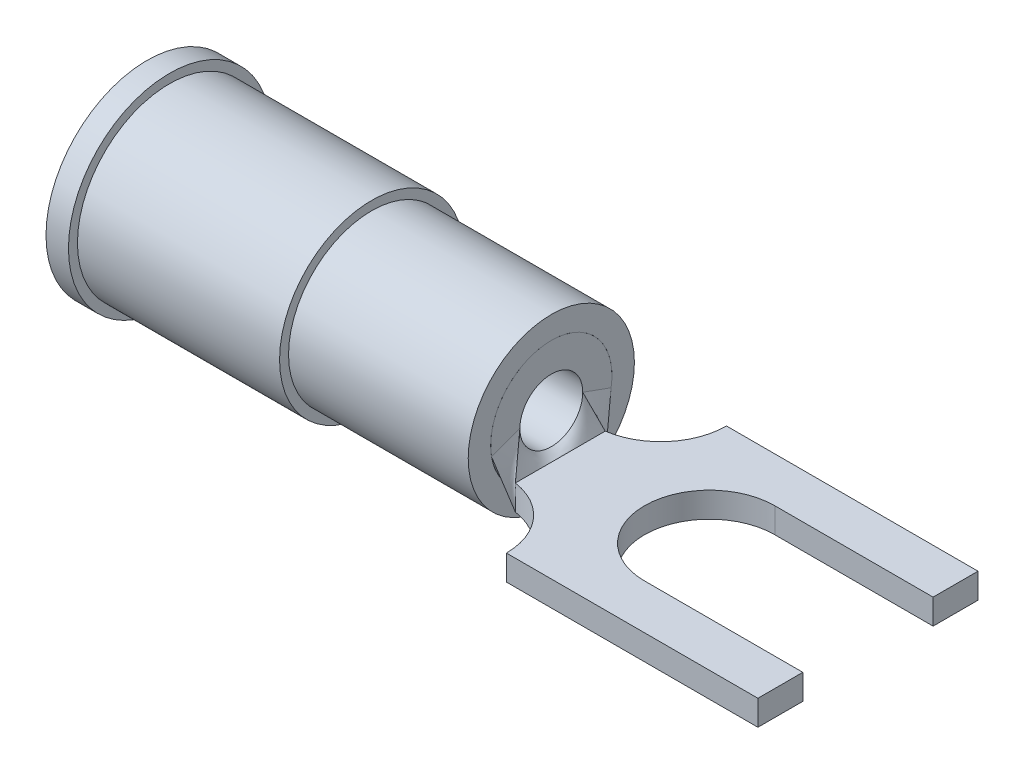
ISO-10303-21;
HEADER;
FILE_DESCRIPTION(('STEP AP214'),'2;1');
FILE_NAME('part.step','',(''),(''),'','','');
FILE_SCHEMA(('AUTOMOTIVE_DESIGN { 1 0 10303 214 1 1 1 1 }'));
ENDSEC;
DATA;
#1=APPLICATION_CONTEXT('core data for automotive mechanical design processes');
#2=APPLICATION_PROTOCOL_DEFINITION('international standard','automotive_design',2000,#1);
#3=PRODUCT_CONTEXT('',#1,'mechanical');
#4=PRODUCT('Part','Part','',(#3));
#5=PRODUCT_RELATED_PRODUCT_CATEGORY('part','',(#4));
#6=PRODUCT_DEFINITION_FORMATION('','',#4);
#7=PRODUCT_DEFINITION_CONTEXT('part definition',#1,'design');
#8=PRODUCT_DEFINITION('design','',#6,#7);
#9=PRODUCT_DEFINITION_SHAPE('','',#8);
#10=(LENGTH_UNIT() NAMED_UNIT(*) SI_UNIT(.MILLI.,.METRE.));
#11=(NAMED_UNIT(*) PLANE_ANGLE_UNIT() SI_UNIT($,.RADIAN.));
#12=(NAMED_UNIT(*) SI_UNIT($,.STERADIAN.) SOLID_ANGLE_UNIT());
#13=UNCERTAINTY_MEASURE_WITH_UNIT(LENGTH_MEASURE(1.E-05),#10,'distance_accuracy_value','');
#14=(GEOMETRIC_REPRESENTATION_CONTEXT(3) GLOBAL_UNCERTAINTY_ASSIGNED_CONTEXT((#13)) GLOBAL_UNIT_ASSIGNED_CONTEXT((#10,
#11,#12)) REPRESENTATION_CONTEXT('',''));
#15=CARTESIAN_POINT('',(0.,0.,0.));
#16=DIRECTION('',(0.,0.,1.));
#17=DIRECTION('',(1.,0.,0.));
#18=AXIS2_PLACEMENT_3D('',#15,#16,#17);
#19=CARTESIAN_POINT('',(11.684,-1.7272,-1.27));
#20=DIRECTION('',(-1.,0.,0.));
#21=DIRECTION('',(0.,0.,1.));
#22=AXIS2_PLACEMENT_3D('',#19,#20,#21);
#23=PLANE('',#22);
#24=DIRECTION('',(0.,0.,1.));
#25=VECTOR('',#24,1.);
#26=CARTESIAN_POINT('',(11.684,-1.016,-1.27));
#27=LINE('',#26,#25);
#28=CARTESIAN_POINT('',(11.684,-1.016,-1.27));
#29=VERTEX_POINT('',#28);
#30=CARTESIAN_POINT('',(11.684,-1.016,1.27));
#31=VERTEX_POINT('',#30);
#32=EDGE_CURVE('E193',#29,#31,#27,.T.);
#33=ORIENTED_EDGE('',*,*,#32,.T.);
#34=DIRECTION('',(0.,1.,0.));
#35=VECTOR('',#34,1.);
#36=CARTESIAN_POINT('',(11.684,-1.7272,1.27));
#37=LINE('',#36,#35);
#38=CARTESIAN_POINT('',(11.684,-1.7272,1.27));
#39=VERTEX_POINT('',#38);
#40=EDGE_CURVE('E102',#39,#31,#37,.T.);
#41=ORIENTED_EDGE('',*,*,#40,.F.);
#42=DIRECTION('',(0.,0.,1.));
#43=VECTOR('',#42,1.);
#44=CARTESIAN_POINT('',(11.684,-1.7272,-1.27));
#45=LINE('',#44,#43);
#46=CARTESIAN_POINT('',(11.684,-1.7272,-1.27));
#47=VERTEX_POINT('',#46);
#48=EDGE_CURVE('E295',#47,#39,#45,.T.);
#49=ORIENTED_EDGE('',*,*,#48,.F.);
#50=DIRECTION('',(0.,1.,0.));
#51=VECTOR('',#50,1.);
#52=CARTESIAN_POINT('',(11.684,-1.7272,-1.27));
#53=LINE('',#52,#51);
#54=EDGE_CURVE('E141',#47,#29,#53,.T.);
#55=ORIENTED_EDGE('',*,*,#54,.T.);
#56=EDGE_LOOP('',(#33,#41,#49,#55));
#57=FACE_BOUND('',#56,.T.);
#58=ADVANCED_FACE('F67',(#57),#23,.F.);
#59=CARTESIAN_POINT('',(11.43,0.,0.));
#60=DIRECTION('',(1.,0.,0.));
#61=DIRECTION('',(0.,0.,-1.));
#62=AXIS2_PLACEMENT_3D('',#59,#60,#61);
#63=PLANE('',#62);
#64=DIRECTION('',(0.,0.34202014332567,-0.939692620785908));
#65=VECTOR('',#64,1.);
#66=CARTESIAN_POINT('',(11.43,0.285719092505667,0.103993245033615));
#67=LINE('',#66,#65);
#68=CARTESIAN_POINT('',(11.43,-0.291379498495464,1.6895585926083));
#69=VERTEX_POINT('',#68);
#70=CARTESIAN_POINT('',(11.43,0.,0.889));
#71=VERTEX_POINT('',#70);
#72=EDGE_CURVE('E135',#69,#71,#67,.T.);
#73=ORIENTED_EDGE('',*,*,#72,.T.);
#74=CARTESIAN_POINT('',(11.43,0.,0.));
#75=DIRECTION('',(1.,0.,0.));
#76=DIRECTION('',(0.,0.,-1.));
#77=AXIS2_PLACEMENT_3D('',#74,#75,#76);
#78=CIRCLE('',#77,0.889);
#79=CARTESIAN_POINT('',(11.43,0.,-0.889));
#80=VERTEX_POINT('',#79);
#81=EDGE_CURVE('E13',#71,#80,#78,.T.);
#82=ORIENTED_EDGE('',*,*,#81,.T.);
#83=DIRECTION('',(0.,-0.34202014332567,-0.939692620785908));
#84=VECTOR('',#83,1.);
#85=CARTESIAN_POINT('',(11.43,0.285719092505667,-0.103993245033615));
#86=LINE('',#85,#84);
#87=CARTESIAN_POINT('',(11.43,-0.291379498495464,-1.6895585926083));
#88=VERTEX_POINT('',#87);
#89=EDGE_CURVE('E78',#80,#88,#86,.T.);
#90=ORIENTED_EDGE('',*,*,#89,.T.);
#91=CARTESIAN_POINT('',(11.43,0.,0.));
#92=DIRECTION('',(1.,0.,0.));
#93=DIRECTION('',(0.,0.,-1.));
#94=AXIS2_PLACEMENT_3D('',#91,#92,#93);
#95=CIRCLE('',#94,1.7145);
#96=EDGE_CURVE('E114',#69,#88,#95,.T.);
#97=ORIENTED_EDGE('',*,*,#96,.F.);
#98=EDGE_LOOP('',(#73,#82,#90,#97));
#99=FACE_BOUND('',#98,.T.);
#100=ADVANCED_FACE('F118',(#99),#63,.F.);
#101=CARTESIAN_POINT('',(11.43,-0.291379498495464,1.6895585926083));
#102=CARTESIAN_POINT('',(11.684,-1.7272,1.27));
#103=CARTESIAN_POINT('',(11.43,-0.430127833182765,1.6656302006868));
#104=CARTESIAN_POINT('',(11.684,-1.7272,1.16416666666667));
#105=CARTESIAN_POINT('',(11.43,-0.581040716903704,1.62218906384854));
#106=CARTESIAN_POINT('',(11.684,-1.7272,1.05833333333333));
#107=CARTESIAN_POINT('',(11.43,-0.891753825247846,1.4744086233896));
#108=CARTESIAN_POINT('',(11.684,-1.7272,0.846666666666665));
#109=CARTESIAN_POINT('',(11.43,-1.05167604388082,1.36940823154506));
#110=CARTESIAN_POINT('',(11.684,-1.7272,0.740833333333331));
#111=CARTESIAN_POINT('',(11.43,-1.3441775724631,1.08373800320161));
#112=CARTESIAN_POINT('',(11.684,-1.7272,0.529166666666664));
#113=CARTESIAN_POINT('',(11.43,-1.47596562928428,0.902303444981081));
#114=CARTESIAN_POINT('',(11.684,-1.7272,0.42333333333333));
#115=CARTESIAN_POINT('',(11.43,-1.66184767881455,0.48050841623427));
#116=CARTESIAN_POINT('',(11.684,-1.7272,0.211666666666663));
#117=CARTESIAN_POINT('',(11.43,-1.7145,0.240688121195688));
#118=CARTESIAN_POINT('',(11.684,-1.7272,0.10583333333333));
#119=CARTESIAN_POINT('',(11.43,-1.7145,-0.240688121195687));
#120=CARTESIAN_POINT('',(11.684,-1.7272,-0.105833333333337));
#121=CARTESIAN_POINT('',(11.43,-1.66184767881455,-0.480508416234269));
#122=CARTESIAN_POINT('',(11.684,-1.7272,-0.21166666666667));
#123=CARTESIAN_POINT('',(11.43,-1.47596562928428,-0.90230344498108));
#124=CARTESIAN_POINT('',(11.684,-1.7272,-0.423333333333336));
#125=CARTESIAN_POINT('',(11.43,-1.3441775724631,-1.08373800320161));
#126=CARTESIAN_POINT('',(11.684,-1.7272,-0.52916666666667));
#127=CARTESIAN_POINT('',(11.43,-1.05167604388082,-1.36940823154506));
#128=CARTESIAN_POINT('',(11.684,-1.7272,-0.740833333333336));
#129=CARTESIAN_POINT('',(11.43,-0.891753825247847,-1.4744086233896));
#130=CARTESIAN_POINT('',(11.684,-1.7272,-0.846666666666669));
#131=CARTESIAN_POINT('',(11.43,-0.581040716903704,-1.62218906384854));
#132=CARTESIAN_POINT('',(11.684,-1.7272,-1.05833333333333));
#133=CARTESIAN_POINT('',(11.43,-0.430127833182766,-1.6656302006868));
#134=CARTESIAN_POINT('',(11.684,-1.7272,-1.16416666666667));
#135=CARTESIAN_POINT('',(11.43,-0.291379498495464,-1.6895585926083));
#136=CARTESIAN_POINT('',(11.684,-1.7272,-1.27));
#137=B_SPLINE_SURFACE_WITH_KNOTS('',3,1,((#101,#102),(#103,#104),(#105,#106),(#107,#108),(#109,
#110),(#111,#112),(#113,#114),(#115,#116),(#117,#118),(#119,#120),(#121,#122),(#123,#124),(#125,
#126),(#127,#128),(#129,#130),(#131,#132),(#133,#134),(#135,#136)),.UNSPECIFIED.,.F.,.F.,.F.,(4,
2,2,2,2,2,2,2,4),(2,2),(0.,0.125,0.25,0.375,0.5,0.625,0.75,0.875,1.),(0.,1.),.UNSPECIFIED.);
#138=DIRECTION('',(0.167405290477298,-0.946314756407977,0.276520976645033));
#139=VECTOR('',#138,1.);
#140=CARTESIAN_POINT('',(11.557,-1.00928974924773,-1.47977929630415));
#141=LINE('',#140,#139);
#142=EDGE_CURVE('E132',#88,#47,#141,.T.);
#143=DIRECTION('',(-0.167405290477298,0.946314756407977,0.276520976645033));
#144=VECTOR('',#143,1.);
#145=CARTESIAN_POINT('',(11.557,-1.00928974924773,1.47977929630415));
#146=LINE('',#145,#144);
#147=EDGE_CURVE('E134',#39,#69,#146,.T.);
#148=ORIENTED_EDGE('',*,*,#96,.T.);
#149=ORIENTED_EDGE('',*,*,#142,.T.);
#150=ORIENTED_EDGE('',*,*,#48,.T.);
#151=ORIENTED_EDGE('',*,*,#147,.T.);
#152=EDGE_LOOP('',(#148,#149,#150,#151));
#153=FACE_BOUND('',#152,.T.);
#154=ADVANCED_FACE('F131',(#153),#137,.T.);
#155=CARTESIAN_POINT('',(11.43,-0.291379498495464,-1.6895585926083));
#156=CARTESIAN_POINT('',(11.684,-1.7272,-1.27));
#157=CARTESIAN_POINT('',(11.43,-0.242816248746221,-1.55613216050692));
#158=CARTESIAN_POINT('',(11.684,-1.60866666666666,-1.27));
#159=CARTESIAN_POINT('',(11.43,-0.194252998996977,-1.42270572840553));
#160=CARTESIAN_POINT('',(11.684,-1.49013333333333,-1.27));
#161=CARTESIAN_POINT('',(11.43,-0.0971264994984887,-1.15585286420277));
#162=CARTESIAN_POINT('',(11.684,-1.25306666666666,-1.27));
#163=CARTESIAN_POINT('',(11.43,-0.0485632497492445,-1.02242643210138));
#164=CARTESIAN_POINT('',(11.684,-1.13453333333333,-1.27));
#165=CARTESIAN_POINT('',(11.43,0.,-0.889));
#166=CARTESIAN_POINT('',(11.684,-1.016,-1.27));
#167=B_SPLINE_SURFACE_WITH_KNOTS('',3,1,((#155,#156),(#157,#158),(#159,#160),(#161,#162),(#163,
#164),(#165,#166)),.UNSPECIFIED.,.F.,.F.,.F.,(4,2,4),(2,2),(0.,0.5,1.),(0.,1.),.UNSPECIFIED.);
#168=DIRECTION('',(0.227921152919277,-0.911684611677103,-0.341881729378914));
#169=VECTOR('',#168,1.);
#170=CARTESIAN_POINT('',(11.557,-0.508,-1.0795));
#171=LINE('',#170,#169);
#172=EDGE_CURVE('E145',#80,#29,#171,.T.);
#173=ORIENTED_EDGE('',*,*,#89,.F.);
#174=ORIENTED_EDGE('',*,*,#172,.T.);
#175=ORIENTED_EDGE('',*,*,#54,.F.);
#176=ORIENTED_EDGE('',*,*,#142,.F.);
#177=EDGE_LOOP('',(#173,#174,#175,#176));
#178=FACE_BOUND('',#177,.T.);
#179=ADVANCED_FACE('F140',(#178),#167,.T.);
#180=CARTESIAN_POINT('',(11.43,0.,0.889));
#181=CARTESIAN_POINT('',(11.684,-1.016,1.27));
#182=CARTESIAN_POINT('',(11.43,-0.0485632497492443,1.02242643210138));
#183=CARTESIAN_POINT('',(11.684,-1.13453333333333,1.27));
#184=CARTESIAN_POINT('',(11.43,-0.0971264994984883,1.15585286420277));
#185=CARTESIAN_POINT('',(11.684,-1.25306666666667,1.27));
#186=CARTESIAN_POINT('',(11.43,-0.194252998996976,1.42270572840553));
#187=CARTESIAN_POINT('',(11.684,-1.49013333333333,1.27));
#188=CARTESIAN_POINT('',(11.43,-0.24281624874622,1.55613216050692));
#189=CARTESIAN_POINT('',(11.684,-1.60866666666667,1.27));
#190=CARTESIAN_POINT('',(11.43,-0.291379498495464,1.6895585926083));
#191=CARTESIAN_POINT('',(11.684,-1.7272,1.27));
#192=B_SPLINE_SURFACE_WITH_KNOTS('',3,1,((#180,#181),(#182,#183),(#184,#185),(#186,#187),(#188,
#189),(#190,#191)),.UNSPECIFIED.,.F.,.F.,.F.,(4,2,4),(2,2),(0.,0.5,1.),(0.,1.),.UNSPECIFIED.);
#193=DIRECTION('',(0.227921152919277,-0.911684611677103,0.341881729378914));
#194=VECTOR('',#193,1.);
#195=CARTESIAN_POINT('',(11.557,-0.508,1.0795));
#196=LINE('',#195,#194);
#197=EDGE_CURVE('E87',#71,#31,#196,.T.);
#198=ORIENTED_EDGE('',*,*,#72,.F.);
#199=ORIENTED_EDGE('',*,*,#147,.F.);
#200=ORIENTED_EDGE('',*,*,#40,.T.);
#201=ORIENTED_EDGE('',*,*,#197,.F.);
#202=EDGE_LOOP('',(#198,#199,#200,#201));
#203=FACE_BOUND('',#202,.T.);
#204=ADVANCED_FACE('F168',(#203),#192,.T.);
#205=CARTESIAN_POINT('',(11.43,0.,-0.889));
#206=CARTESIAN_POINT('',(11.684,-1.016,-1.27));
#207=CARTESIAN_POINT('',(11.43,-0.0740833333333333,-0.889));
#208=CARTESIAN_POINT('',(11.684,-1.016,-1.16416666666667));
#209=CARTESIAN_POINT('',(11.43,-0.1578864,-0.879991466666667));
#210=CARTESIAN_POINT('',(11.684,-1.016,-1.05833333333333));
#211=CARTESIAN_POINT('',(11.43,-0.3399536,-0.826888533333334));
#212=CARTESIAN_POINT('',(11.684,-1.016,-0.846666666666666));
#213=CARTESIAN_POINT('',(11.43,-0.438573333333333,-0.78232));
#214=CARTESIAN_POINT('',(11.684,-1.016,-0.740833333333333));
#215=CARTESIAN_POINT('',(11.43,-0.628226666666667,-0.64008));
#216=CARTESIAN_POINT('',(11.684,-1.016,-0.529166666666666));
#217=CARTESIAN_POINT('',(11.43,-0.718787773933103,-0.541397923875433));
#218=CARTESIAN_POINT('',(11.684,-1.016,-0.423333333333333));
#219=CARTESIAN_POINT('',(11.43,-0.850035755478662,-0.295307958477509));
#220=CARTESIAN_POINT('',(11.684,-1.016,-0.211666666666666));
#221=CARTESIAN_POINT('',(11.43,-0.889,-0.148166666666667));
#222=CARTESIAN_POINT('',(11.684,-1.016,-0.105833333333333));
#223=CARTESIAN_POINT('',(11.43,-0.889,0.148166666666667));
#224=CARTESIAN_POINT('',(11.684,-1.016,0.105833333333334));
#225=CARTESIAN_POINT('',(11.43,-0.850035755478662,0.295307958477509));
#226=CARTESIAN_POINT('',(11.684,-1.016,0.211666666666668));
#227=CARTESIAN_POINT('',(11.43,-0.718787773933103,0.541397923875433));
#228=CARTESIAN_POINT('',(11.684,-1.016,0.423333333333334));
#229=CARTESIAN_POINT('',(11.43,-0.628226666666667,0.64008));
#230=CARTESIAN_POINT('',(11.684,-1.016,0.529166666666667));
#231=CARTESIAN_POINT('',(11.43,-0.438573333333333,0.78232));
#232=CARTESIAN_POINT('',(11.684,-1.016,0.740833333333334));
#233=CARTESIAN_POINT('',(11.43,-0.3399536,0.826888533333334));
#234=CARTESIAN_POINT('',(11.684,-1.016,0.846666666666667));
#235=CARTESIAN_POINT('',(11.43,-0.1578864,0.879991466666667));
#236=CARTESIAN_POINT('',(11.684,-1.016,1.05833333333333));
#237=CARTESIAN_POINT('',(11.43,-0.0740833333333332,0.889));
#238=CARTESIAN_POINT('',(11.684,-1.016,1.16416666666667));
#239=CARTESIAN_POINT('',(11.43,0.,0.889));
#240=CARTESIAN_POINT('',(11.684,-1.016,1.27));
#241=B_SPLINE_SURFACE_WITH_KNOTS('',3,1,((#205,#206),(#207,#208),(#209,#210),(#211,#212),(#213,
#214),(#215,#216),(#217,#218),(#219,#220),(#221,#222),(#223,#224),(#225,#226),(#227,#228),(#229,
#230),(#231,#232),(#233,#234),(#235,#236),(#237,#238),(#239,#240)),.UNSPECIFIED.,.F.,.F.,.F.,(4,
2,2,2,2,2,2,2,4),(2,2),(0.,0.125,0.25,0.375,0.5,0.625,0.75,0.875,1.),(0.,1.),.UNSPECIFIED.);
#242=ORIENTED_EDGE('',*,*,#81,.F.);
#243=ORIENTED_EDGE('',*,*,#197,.T.);
#244=ORIENTED_EDGE('',*,*,#32,.F.);
#245=ORIENTED_EDGE('',*,*,#172,.F.);
#246=EDGE_LOOP('',(#242,#243,#244,#245));
#247=FACE_BOUND('',#246,.T.);
#248=ADVANCED_FACE('F198',(#247),#241,.T.);
#249=CLOSED_SHELL('',(#58,#100,#154,#179,#204,#248));
#250=MANIFOLD_SOLID_BREP('B2',#249);
#251=CARTESIAN_POINT('',(11.43,0.,0.));
#252=DIRECTION('',(1.,0.,0.));
#253=DIRECTION('',(0.,0.,-1.));
#254=AXIS2_PLACEMENT_3D('',#251,#252,#253);
#255=PLANE('',#254);
#256=CARTESIAN_POINT('',(11.43,0.,0.));
#257=DIRECTION('',(1.,0.,0.));
#258=DIRECTION('',(0.,0.,-1.));
#259=AXIS2_PLACEMENT_3D('',#256,#257,#258);
#260=CIRCLE('',#259,1.7145);
#261=CARTESIAN_POINT('',(11.43,-0.291379498495464,-1.6895585926083));
#262=VERTEX_POINT('',#261);
#263=CARTESIAN_POINT('',(11.43,-0.291379498495464,1.6895585926083));
#264=VERTEX_POINT('',#263);
#265=EDGE_CURVE('E449',#262,#264,#260,.T.);
#266=ORIENTED_EDGE('',*,*,#265,.T.);
#267=DIRECTION('',(0.,0.34202014332567,-0.939692620785908));
#268=VECTOR('',#267,1.);
#269=CARTESIAN_POINT('',(11.43,0.285719092505667,0.103993245033615));
#270=LINE('',#269,#268);
#271=CARTESIAN_POINT('',(11.43,0.,0.889));
#272=VERTEX_POINT('',#271);
#273=EDGE_CURVE('E65',#264,#272,#270,.T.);
#274=ORIENTED_EDGE('',*,*,#273,.T.);
#275=CARTESIAN_POINT('',(11.43,0.,0.));
#276=DIRECTION('',(1.,0.,0.));
#277=DIRECTION('',(0.,0.,-1.));
#278=AXIS2_PLACEMENT_3D('',#275,#276,#277);
#279=CIRCLE('',#278,0.889);
#280=CARTESIAN_POINT('',(11.43,0.,-0.889));
#281=VERTEX_POINT('',#280);
#282=EDGE_CURVE('E447',#281,#272,#279,.T.);
#283=ORIENTED_EDGE('',*,*,#282,.F.);
#284=DIRECTION('',(0.,-0.34202014332567,-0.939692620785908));
#285=VECTOR('',#284,1.);
#286=CARTESIAN_POINT('',(11.43,0.285719092505667,-0.103993245033615));
#287=LINE('',#286,#285);
#288=EDGE_CURVE('E421',#281,#262,#287,.T.);
#289=ORIENTED_EDGE('',*,*,#288,.T.);
#290=EDGE_LOOP('',(#266,#274,#283,#289));
#291=FACE_BOUND('',#290,.T.);
#292=ADVANCED_FACE('F412',(#291),#255,.T.);
#293=CARTESIAN_POINT('',(-4.84933830537734,0.,0.));
#294=DIRECTION('',(1.,0.,0.));
#295=DIRECTION('',(0.,0.,-1.));
#296=AXIS2_PLACEMENT_3D('',#293,#294,#295);
#297=CYLINDRICAL_SURFACE('',#296,1.7145);
#298=CARTESIAN_POINT('',(6.35,0.,0.));
#299=DIRECTION('',(1.,0.,0.));
#300=DIRECTION('',(0.,0.,-1.));
#301=AXIS2_PLACEMENT_3D('',#298,#299,#300);
#302=CIRCLE('',#301,1.7145);
#303=CARTESIAN_POINT('',(6.35,0.,-1.7145));
#304=VERTEX_POINT('',#303);
#305=EDGE_CURVE('E444',#304,#304,#302,.F.);
#306=ORIENTED_EDGE('',*,*,#305,.F.);
#307=EDGE_LOOP('',(#306));
#308=FACE_BOUND('',#307,.T.);
#309=EDGE_CURVE('E442',#264,#262,#260,.T.);
#310=ORIENTED_EDGE('',*,*,#309,.F.);
#311=ORIENTED_EDGE('',*,*,#265,.F.);
#312=EDGE_LOOP('',(#310,#311));
#313=FACE_BOUND('',#312,.T.);
#314=ADVANCED_FACE('F414',(#308,#313),#297,.T.);
#315=ORIENTED_EDGE('',*,*,#273,.F.);
#316=ORIENTED_EDGE('',*,*,#309,.T.);
#317=ORIENTED_EDGE('',*,*,#288,.F.);
#318=EDGE_CURVE('E439',#272,#281,#279,.T.);
#319=ORIENTED_EDGE('',*,*,#318,.F.);
#320=EDGE_LOOP('',(#315,#316,#317,#319));
#321=FACE_BOUND('',#320,.T.);
#322=ADVANCED_FACE('F438',(#321),#255,.T.);
#323=CARTESIAN_POINT('',(-4.84933830537734,0.,0.));
#324=DIRECTION('',(1.,0.,0.));
#325=DIRECTION('',(0.,0.,-1.));
#326=AXIS2_PLACEMENT_3D('',#323,#324,#325);
#327=CYLINDRICAL_SURFACE('',#326,0.889);
#328=CARTESIAN_POINT('',(6.35,0.,0.));
#329=DIRECTION('',(1.,0.,0.));
#330=DIRECTION('',(0.,0.,-1.));
#331=AXIS2_PLACEMENT_3D('',#328,#329,#330);
#332=CIRCLE('',#331,0.889);
#333=CARTESIAN_POINT('',(6.35,0.,-0.889));
#334=VERTEX_POINT('',#333);
#335=EDGE_CURVE('E453',#334,#334,#332,.F.);
#336=ORIENTED_EDGE('',*,*,#335,.T.);
#337=EDGE_LOOP('',(#336));
#338=FACE_BOUND('',#337,.T.);
#339=ORIENTED_EDGE('',*,*,#282,.T.);
#340=ORIENTED_EDGE('',*,*,#318,.T.);
#341=EDGE_LOOP('',(#339,#340));
#342=FACE_BOUND('',#341,.T.);
#343=ADVANCED_FACE('F446',(#338,#342),#327,.F.);
#344=CARTESIAN_POINT('',(6.35,2.8575,0.));
#345=DIRECTION('',(1.,0.,0.));
#346=DIRECTION('',(0.,0.,-1.));
#347=AXIS2_PLACEMENT_3D('',#344,#345,#346);
#348=PLANE('',#347);
#349=ORIENTED_EDGE('',*,*,#305,.T.);
#350=EDGE_LOOP('',(#349));
#351=FACE_BOUND('',#350,.T.);
#352=ORIENTED_EDGE('',*,*,#335,.F.);
#353=EDGE_LOOP('',(#352));
#354=FACE_BOUND('',#353,.T.);
#355=ADVANCED_FACE('F460',(#351,#354),#348,.F.);
#356=CLOSED_SHELL('',(#292,#314,#322,#343,#355));
#357=MANIFOLD_SOLID_BREP('B7',#356);
#358=CARTESIAN_POINT('',(11.40968,-1.7272,-3.1115));
#359=DIRECTION('',(0.,1.,0.));
#360=DIRECTION('',(0.,0.,1.));
#361=AXIS2_PLACEMENT_3D('',#358,#359,#360);
#362=CYLINDRICAL_SURFACE('',#361,1.86182);
#363=CARTESIAN_POINT('',(11.40968,-1.016,-3.1115));
#364=DIRECTION('',(0.,-1.,0.));
#365=DIRECTION('',(0.,0.,-1.));
#366=AXIS2_PLACEMENT_3D('',#363,#364,#365);
#367=CIRCLE('',#366,1.86182);
#368=CARTESIAN_POINT('',(13.2715,-1.016,-3.1115));
#369=VERTEX_POINT('',#368);
#370=CARTESIAN_POINT('',(11.684,-1.016,-1.27));
#371=VERTEX_POINT('',#370);
#372=EDGE_CURVE('E630',#369,#371,#367,.T.);
#373=ORIENTED_EDGE('',*,*,#372,.F.);
#374=DIRECTION('',(0.,1.,0.));
#375=VECTOR('',#374,1.);
#376=CARTESIAN_POINT('',(13.2715,-1.7272,-3.1115));
#377=LINE('',#376,#375);
#378=CARTESIAN_POINT('',(13.2715,-1.7272,-3.1115));
#379=VERTEX_POINT('',#378);
#380=EDGE_CURVE('E410',#379,#369,#377,.T.);
#381=ORIENTED_EDGE('',*,*,#380,.F.);
#382=CARTESIAN_POINT('',(11.40968,-1.7272,-3.1115));
#383=DIRECTION('',(0.,-1.,0.));
#384=DIRECTION('',(0.,0.,-1.));
#385=AXIS2_PLACEMENT_3D('',#382,#383,#384);
#386=CIRCLE('',#385,1.86182);
#387=CARTESIAN_POINT('',(11.684,-1.7272,-1.27));
#388=VERTEX_POINT('',#387);
#389=EDGE_CURVE('E656',#379,#388,#386,.T.);
#390=ORIENTED_EDGE('',*,*,#389,.T.);
#391=DIRECTION('',(0.,1.,0.));
#392=VECTOR('',#391,1.);
#393=CARTESIAN_POINT('',(11.684,-1.7272,-1.27));
#394=LINE('',#393,#392);
#395=EDGE_CURVE('E524',#388,#371,#394,.T.);
#396=ORIENTED_EDGE('',*,*,#395,.T.);
#397=EDGE_LOOP('',(#373,#381,#390,#396));
#398=FACE_BOUND('',#397,.T.);
#399=ADVANCED_FACE('F521',(#398),#362,.F.);
#400=CARTESIAN_POINT('',(13.2715,-1.7272,-3.1115));
#401=DIRECTION('',(0.,0.,-1.));
#402=DIRECTION('',(-1.,0.,0.));
#403=AXIS2_PLACEMENT_3D('',#400,#401,#402);
#404=PLANE('',#403);
#405=DIRECTION('',(-1.,0.,0.));
#406=VECTOR('',#405,1.);
#407=CARTESIAN_POINT('',(13.2715,-1.016,-3.1115));
#408=LINE('',#407,#406);
#409=CARTESIAN_POINT('',(20.3835,-1.016,-3.1115));
#410=VERTEX_POINT('',#409);
#411=EDGE_CURVE('E654',#410,#369,#408,.T.);
#412=ORIENTED_EDGE('',*,*,#411,.F.);
#413=DIRECTION('',(0.,1.,0.));
#414=VECTOR('',#413,1.);
#415=CARTESIAN_POINT('',(20.3835,-1.7272,-3.1115));
#416=LINE('',#415,#414);
#417=CARTESIAN_POINT('',(20.3835,-1.7272,-3.1115));
#418=VERTEX_POINT('',#417);
#419=EDGE_CURVE('E530',#418,#410,#416,.T.);
#420=ORIENTED_EDGE('',*,*,#419,.F.);
#421=DIRECTION('',(-1.,0.,0.));
#422=VECTOR('',#421,1.);
#423=CARTESIAN_POINT('',(13.2715,-1.7272,-3.1115));
#424=LINE('',#423,#422);
#425=EDGE_CURVE('E620',#418,#379,#424,.T.);
#426=ORIENTED_EDGE('',*,*,#425,.T.);
#427=ORIENTED_EDGE('',*,*,#380,.T.);
#428=EDGE_LOOP('',(#412,#420,#426,#427));
#429=FACE_BOUND('',#428,.T.);
#430=ADVANCED_FACE('F672',(#429),#404,.T.);
#431=CARTESIAN_POINT('',(20.3835,-1.7272,-3.1115));
#432=DIRECTION('',(1.,0.,0.));
#433=DIRECTION('',(0.,0.,-1.));
#434=AXIS2_PLACEMENT_3D('',#431,#432,#433);
#435=PLANE('',#434);
#436=DIRECTION('',(0.,0.,-1.));
#437=VECTOR('',#436,1.);
#438=CARTESIAN_POINT('',(20.3835,-1.016,-3.1115));
#439=LINE('',#438,#437);
#440=CARTESIAN_POINT('',(20.3835,-1.016,-1.8415));
#441=VERTEX_POINT('',#440);
#442=EDGE_CURVE('E607',#441,#410,#439,.T.);
#443=ORIENTED_EDGE('',*,*,#442,.F.);
#444=DIRECTION('',(0.,1.,0.));
#445=VECTOR('',#444,1.);
#446=CARTESIAN_POINT('',(20.3835,-1.7272,-1.8415));
#447=LINE('',#446,#445);
#448=CARTESIAN_POINT('',(20.3835,-1.7272,-1.8415));
#449=VERTEX_POINT('',#448);
#450=EDGE_CURVE('E602',#449,#441,#447,.T.);
#451=ORIENTED_EDGE('',*,*,#450,.F.);
#452=DIRECTION('',(0.,0.,-1.));
#453=VECTOR('',#452,1.);
#454=CARTESIAN_POINT('',(20.3835,-1.7272,-3.1115));
#455=LINE('',#454,#453);
#456=EDGE_CURVE('E605',#449,#418,#455,.T.);
#457=ORIENTED_EDGE('',*,*,#456,.T.);
#458=ORIENTED_EDGE('',*,*,#419,.T.);
#459=EDGE_LOOP('',(#443,#451,#457,#458));
#460=FACE_BOUND('',#459,.T.);
#461=ADVANCED_FACE('F604',(#460),#435,.T.);
#462=CARTESIAN_POINT('',(20.3835,-1.7272,-1.8415));
#463=DIRECTION('',(0.,0.,1.));
#464=DIRECTION('',(1.,0.,0.));
#465=AXIS2_PLACEMENT_3D('',#462,#463,#464);
#466=PLANE('',#465);
#467=DIRECTION('',(1.,0.,0.));
#468=VECTOR('',#467,1.);
#469=CARTESIAN_POINT('',(20.3835,-1.016,-1.8415));
#470=LINE('',#469,#468);
#471=CARTESIAN_POINT('',(15.90675,-1.016,-1.8415));
#472=VERTEX_POINT('',#471);
#473=EDGE_CURVE('E651',#472,#441,#470,.T.);
#474=ORIENTED_EDGE('',*,*,#473,.F.);
#475=DIRECTION('',(0.,1.,0.));
#476=VECTOR('',#475,1.);
#477=CARTESIAN_POINT('',(15.90675,-1.7272,-1.8415));
#478=LINE('',#477,#476);
#479=CARTESIAN_POINT('',(15.90675,-1.7272,-1.8415));
#480=VERTEX_POINT('',#479);
#481=EDGE_CURVE('E612',#480,#472,#478,.T.);
#482=ORIENTED_EDGE('',*,*,#481,.F.);
#483=DIRECTION('',(1.,0.,0.));
#484=VECTOR('',#483,1.);
#485=CARTESIAN_POINT('',(20.3835,-1.7272,-1.8415));
#486=LINE('',#485,#484);
#487=EDGE_CURVE('E618',#480,#449,#486,.T.);
#488=ORIENTED_EDGE('',*,*,#487,.T.);
#489=ORIENTED_EDGE('',*,*,#450,.T.);
#490=EDGE_LOOP('',(#474,#482,#488,#489));
#491=FACE_BOUND('',#490,.T.);
#492=ADVANCED_FACE('F622',(#491),#466,.T.);
#493=CARTESIAN_POINT('',(15.90675,-1.7272,0.));
#494=DIRECTION('',(0.,1.,0.));
#495=DIRECTION('',(0.,0.,1.));
#496=AXIS2_PLACEMENT_3D('',#493,#494,#495);
#497=CYLINDRICAL_SURFACE('',#496,1.8415);
#498=CARTESIAN_POINT('',(15.90675,-1.016,0.));
#499=DIRECTION('',(0.,-1.,0.));
#500=DIRECTION('',(0.,0.,1.));
#501=AXIS2_PLACEMENT_3D('',#498,#499,#500);
#502=CIRCLE('',#501,1.8415);
#503=CARTESIAN_POINT('',(15.90675,-1.016,1.8415));
#504=VERTEX_POINT('',#503);
#505=EDGE_CURVE('E648',#504,#472,#502,.T.);
#506=ORIENTED_EDGE('',*,*,#505,.F.);
#507=DIRECTION('',(0.,1.,0.));
#508=VECTOR('',#507,1.);
#509=CARTESIAN_POINT('',(15.90675,-1.7272,1.8415));
#510=LINE('',#509,#508);
#511=CARTESIAN_POINT('',(15.90675,-1.7272,1.8415));
#512=VERTEX_POINT('',#511);
#513=EDGE_CURVE('E660',#512,#504,#510,.T.);
#514=ORIENTED_EDGE('',*,*,#513,.F.);
#515=CARTESIAN_POINT('',(15.90675,-1.7272,0.));
#516=DIRECTION('',(0.,-1.,0.));
#517=DIRECTION('',(0.,0.,1.));
#518=AXIS2_PLACEMENT_3D('',#515,#516,#517);
#519=CIRCLE('',#518,1.8415);
#520=EDGE_CURVE('E623',#512,#480,#519,.T.);
#521=ORIENTED_EDGE('',*,*,#520,.T.);
#522=ORIENTED_EDGE('',*,*,#481,.T.);
#523=EDGE_LOOP('',(#506,#514,#521,#522));
#524=FACE_BOUND('',#523,.T.);
#525=ADVANCED_FACE('F685',(#524),#497,.F.);
#526=CARTESIAN_POINT('',(20.3835,-1.7272,1.8415));
#527=DIRECTION('',(0.,0.,-1.));
#528=DIRECTION('',(-1.,0.,0.));
#529=AXIS2_PLACEMENT_3D('',#526,#527,#528);
#530=PLANE('',#529);
#531=DIRECTION('',(-1.,0.,0.));
#532=VECTOR('',#531,1.);
#533=CARTESIAN_POINT('',(20.3835,-1.016,1.8415));
#534=LINE('',#533,#532);
#535=CARTESIAN_POINT('',(20.3835,-1.016,1.8415));
#536=VERTEX_POINT('',#535);
#537=EDGE_CURVE('E645',#536,#504,#534,.T.);
#538=ORIENTED_EDGE('',*,*,#537,.F.);
#539=DIRECTION('',(0.,1.,0.));
#540=VECTOR('',#539,1.);
#541=CARTESIAN_POINT('',(20.3835,-1.7272,1.8415));
#542=LINE('',#541,#540);
#543=CARTESIAN_POINT('',(20.3835,-1.7272,1.8415));
#544=VERTEX_POINT('',#543);
#545=EDGE_CURVE('E662',#544,#536,#542,.T.);
#546=ORIENTED_EDGE('',*,*,#545,.F.);
#547=DIRECTION('',(-1.,0.,0.));
#548=VECTOR('',#547,1.);
#549=CARTESIAN_POINT('',(20.3835,-1.7272,1.8415));
#550=LINE('',#549,#548);
#551=EDGE_CURVE('E625',#544,#512,#550,.T.);
#552=ORIENTED_EDGE('',*,*,#551,.T.);
#553=ORIENTED_EDGE('',*,*,#513,.T.);
#554=EDGE_LOOP('',(#538,#546,#552,#553));
#555=FACE_BOUND('',#554,.T.);
#556=ADVANCED_FACE('F688',(#555),#530,.T.);
#557=CARTESIAN_POINT('',(20.3835,-1.7272,3.1115));
#558=DIRECTION('',(1.,0.,0.));
#559=DIRECTION('',(0.,0.,-1.));
#560=AXIS2_PLACEMENT_3D('',#557,#558,#559);
#561=PLANE('',#560);
#562=DIRECTION('',(0.,0.,-1.));
#563=VECTOR('',#562,1.);
#564=CARTESIAN_POINT('',(20.3835,-1.016,3.1115));
#565=LINE('',#564,#563);
#566=CARTESIAN_POINT('',(20.3835,-1.016,3.1115));
#567=VERTEX_POINT('',#566);
#568=EDGE_CURVE('E642',#567,#536,#565,.T.);
#569=ORIENTED_EDGE('',*,*,#568,.F.);
#570=DIRECTION('',(0.,1.,0.));
#571=VECTOR('',#570,1.);
#572=CARTESIAN_POINT('',(20.3835,-1.7272,3.1115));
#573=LINE('',#572,#571);
#574=CARTESIAN_POINT('',(20.3835,-1.7272,3.1115));
#575=VERTEX_POINT('',#574);
#576=EDGE_CURVE('E664',#575,#567,#573,.T.);
#577=ORIENTED_EDGE('',*,*,#576,.F.);
#578=DIRECTION('',(0.,0.,-1.));
#579=VECTOR('',#578,1.);
#580=CARTESIAN_POINT('',(20.3835,-1.7272,3.1115));
#581=LINE('',#580,#579);
#582=EDGE_CURVE('E787',#575,#544,#581,.T.);
#583=ORIENTED_EDGE('',*,*,#582,.T.);
#584=ORIENTED_EDGE('',*,*,#545,.T.);
#585=EDGE_LOOP('',(#569,#577,#583,#584));
#586=FACE_BOUND('',#585,.T.);
#587=ADVANCED_FACE('F692',(#586),#561,.T.);
#588=CARTESIAN_POINT('',(13.2715,-1.7272,3.1115));
#589=DIRECTION('',(0.,0.,1.));
#590=DIRECTION('',(1.,0.,0.));
#591=AXIS2_PLACEMENT_3D('',#588,#589,#590);
#592=PLANE('',#591);
#593=DIRECTION('',(1.,0.,0.));
#594=VECTOR('',#593,1.);
#595=CARTESIAN_POINT('',(13.2715,-1.016,3.1115));
#596=LINE('',#595,#594);
#597=CARTESIAN_POINT('',(13.2715,-1.016,3.1115));
#598=VERTEX_POINT('',#597);
#599=EDGE_CURVE('E639',#598,#567,#596,.T.);
#600=ORIENTED_EDGE('',*,*,#599,.F.);
#601=DIRECTION('',(0.,1.,0.));
#602=VECTOR('',#601,1.);
#603=CARTESIAN_POINT('',(13.2715,-1.7272,3.1115));
#604=LINE('',#603,#602);
#605=CARTESIAN_POINT('',(13.2715,-1.7272,3.1115));
#606=VERTEX_POINT('',#605);
#607=EDGE_CURVE('E666',#606,#598,#604,.T.);
#608=ORIENTED_EDGE('',*,*,#607,.F.);
#609=DIRECTION('',(1.,0.,0.));
#610=VECTOR('',#609,1.);
#611=CARTESIAN_POINT('',(13.2715,-1.7272,3.1115));
#612=LINE('',#611,#610);
#613=EDGE_CURVE('E783',#606,#575,#612,.T.);
#614=ORIENTED_EDGE('',*,*,#613,.T.);
#615=ORIENTED_EDGE('',*,*,#576,.T.);
#616=EDGE_LOOP('',(#600,#608,#614,#615));
#617=FACE_BOUND('',#616,.T.);
#618=ADVANCED_FACE('F696',(#617),#592,.T.);
#619=CARTESIAN_POINT('',(11.40968,-1.7272,3.1115));
#620=DIRECTION('',(0.,1.,0.));
#621=DIRECTION('',(0.,0.,1.));
#622=AXIS2_PLACEMENT_3D('',#619,#620,#621);
#623=CYLINDRICAL_SURFACE('',#622,1.86182);
#624=CARTESIAN_POINT('',(11.40968,-1.016,3.1115));
#625=DIRECTION('',(0.,-1.,0.));
#626=DIRECTION('',(0.,0.,1.));
#627=AXIS2_PLACEMENT_3D('',#624,#625,#626);
#628=CIRCLE('',#627,1.86182);
#629=CARTESIAN_POINT('',(11.684,-1.016,1.27));
#630=VERTEX_POINT('',#629);
#631=EDGE_CURVE('E636',#630,#598,#628,.T.);
#632=ORIENTED_EDGE('',*,*,#631,.F.);
#633=DIRECTION('',(0.,1.,0.));
#634=VECTOR('',#633,1.);
#635=CARTESIAN_POINT('',(11.684,-1.7272,1.27));
#636=LINE('',#635,#634);
#637=CARTESIAN_POINT('',(11.684,-1.7272,1.27));
#638=VERTEX_POINT('',#637);
#639=EDGE_CURVE('E667',#638,#630,#636,.T.);
#640=ORIENTED_EDGE('',*,*,#639,.F.);
#641=CARTESIAN_POINT('',(11.40968,-1.7272,3.1115));
#642=DIRECTION('',(0.,-1.,0.));
#643=DIRECTION('',(0.,0.,1.));
#644=AXIS2_PLACEMENT_3D('',#641,#642,#643);
#645=CIRCLE('',#644,1.86182);
#646=EDGE_CURVE('E794',#638,#606,#645,.T.);
#647=ORIENTED_EDGE('',*,*,#646,.T.);
#648=ORIENTED_EDGE('',*,*,#607,.T.);
#649=EDGE_LOOP('',(#632,#640,#647,#648));
#650=FACE_BOUND('',#649,.T.);
#651=ADVANCED_FACE('F700',(#650),#623,.F.);
#652=CARTESIAN_POINT('',(11.684,-1.7272,-1.27));
#653=DIRECTION('',(-1.,0.,0.));
#654=DIRECTION('',(0.,0.,1.));
#655=AXIS2_PLACEMENT_3D('',#652,#653,#654);
#656=PLANE('',#655);
#657=DIRECTION('',(0.,0.,1.));
#658=VECTOR('',#657,1.);
#659=CARTESIAN_POINT('',(11.684,-1.016,-1.27));
#660=LINE('',#659,#658);
#661=EDGE_CURVE('E633',#371,#630,#660,.T.);
#662=ORIENTED_EDGE('',*,*,#661,.F.);
#663=ORIENTED_EDGE('',*,*,#395,.F.);
#664=DIRECTION('',(0.,0.,1.));
#665=VECTOR('',#664,1.);
#666=CARTESIAN_POINT('',(11.684,-1.7272,-1.27));
#667=LINE('',#666,#665);
#668=EDGE_CURVE('E796',#388,#638,#667,.T.);
#669=ORIENTED_EDGE('',*,*,#668,.T.);
#670=ORIENTED_EDGE('',*,*,#639,.T.);
#671=EDGE_LOOP('',(#662,#663,#669,#670));
#672=FACE_BOUND('',#671,.T.);
#673=ADVANCED_FACE('F669',(#672),#656,.T.);
#674=CARTESIAN_POINT('',(11.40968,-1.7272,-3.1115));
#675=DIRECTION('',(0.,-1.,0.));
#676=DIRECTION('',(0.,0.,-1.));
#677=AXIS2_PLACEMENT_3D('',#674,#675,#676);
#678=PLANE('',#677);
#679=ORIENTED_EDGE('',*,*,#389,.F.);
#680=ORIENTED_EDGE('',*,*,#425,.F.);
#681=ORIENTED_EDGE('',*,*,#456,.F.);
#682=ORIENTED_EDGE('',*,*,#487,.F.);
#683=ORIENTED_EDGE('',*,*,#520,.F.);
#684=ORIENTED_EDGE('',*,*,#551,.F.);
#685=ORIENTED_EDGE('',*,*,#582,.F.);
#686=ORIENTED_EDGE('',*,*,#613,.F.);
#687=ORIENTED_EDGE('',*,*,#646,.F.);
#688=ORIENTED_EDGE('',*,*,#668,.F.);
#689=EDGE_LOOP('',(#679,#680,#681,#682,#683,#684,#685,#686,#687,#688));
#690=FACE_BOUND('',#689,.T.);
#691=ADVANCED_FACE('F616',(#690),#678,.T.);
#692=CARTESIAN_POINT('',(11.40968,-1.016,-3.1115));
#693=DIRECTION('',(0.,-1.,0.));
#694=DIRECTION('',(0.,0.,-1.));
#695=AXIS2_PLACEMENT_3D('',#692,#693,#694);
#696=PLANE('',#695);
#697=ORIENTED_EDGE('',*,*,#372,.T.);
#698=ORIENTED_EDGE('',*,*,#661,.T.);
#699=ORIENTED_EDGE('',*,*,#631,.T.);
#700=ORIENTED_EDGE('',*,*,#599,.T.);
#701=ORIENTED_EDGE('',*,*,#568,.T.);
#702=ORIENTED_EDGE('',*,*,#537,.T.);
#703=ORIENTED_EDGE('',*,*,#505,.T.);
#704=ORIENTED_EDGE('',*,*,#473,.T.);
#705=ORIENTED_EDGE('',*,*,#442,.T.);
#706=ORIENTED_EDGE('',*,*,#411,.T.);
#707=EDGE_LOOP('',(#697,#698,#699,#700,#701,#702,#703,#704,#705,#706));
#708=FACE_BOUND('',#707,.T.);
#709=ADVANCED_FACE('F671',(#708),#696,.F.);
#710=CLOSED_SHELL('',(#399,#430,#461,#492,#525,#556,#587,#618,#651,#673,#691,#709));
#711=MANIFOLD_SOLID_BREP('B59',#710);
#712=CARTESIAN_POINT('',(0.,2.8575,0.));
#713=DIRECTION('',(1.,0.,0.));
#714=DIRECTION('',(0.,0.,-1.));
#715=AXIS2_PLACEMENT_3D('',#712,#713,#714);
#716=PLANE('',#715);
#717=CARTESIAN_POINT('',(0.,0.,0.));
#718=DIRECTION('',(-1.,0.,0.));
#719=DIRECTION('',(0.,0.,1.));
#720=AXIS2_PLACEMENT_3D('',#717,#718,#719);
#721=CIRCLE('',#720,1.8923);
#722=CARTESIAN_POINT('',(0.,0.,1.8923));
#723=VERTEX_POINT('',#722);
#724=EDGE_CURVE('E520',#723,#723,#721,.T.);
#725=ORIENTED_EDGE('',*,*,#724,.F.);
#726=EDGE_LOOP('',(#725));
#727=FACE_BOUND('',#726,.T.);
#728=CARTESIAN_POINT('',(0.,0.,0.));
#729=DIRECTION('',(-1.,0.,0.));
#730=DIRECTION('',(0.,0.,1.));
#731=AXIS2_PLACEMENT_3D('',#728,#729,#730);
#732=CIRCLE('',#731,2.8575);
#733=CARTESIAN_POINT('',(0.,0.,2.8575));
#734=VERTEX_POINT('',#733);
#735=EDGE_CURVE('E838',#734,#734,#732,.T.);
#736=ORIENTED_EDGE('',*,*,#735,.T.);
#737=EDGE_LOOP('',(#736));
#738=FACE_BOUND('',#737,.T.);
#739=ADVANCED_FACE('F801',(#727,#738),#716,.F.);
#740=CARTESIAN_POINT('',(0.,0.,0.));
#741=DIRECTION('',(-1.,0.,0.));
#742=DIRECTION('',(0.,0.,1.));
#743=AXIS2_PLACEMENT_3D('',#740,#741,#742);
#744=CYLINDRICAL_SURFACE('',#743,1.8923);
#745=CARTESIAN_POINT('',(0.635,0.,0.));
#746=DIRECTION('',(-1.,0.,0.));
#747=DIRECTION('',(0.,0.,1.));
#748=AXIS2_PLACEMENT_3D('',#745,#746,#747);
#749=CIRCLE('',#748,1.8923);
#750=CARTESIAN_POINT('',(0.635,0.,1.8923));
#751=VERTEX_POINT('',#750);
#752=EDGE_CURVE('E807',#751,#751,#749,.T.);
#753=ORIENTED_EDGE('',*,*,#752,.F.);
#754=EDGE_LOOP('',(#753));
#755=FACE_BOUND('',#754,.T.);
#756=ORIENTED_EDGE('',*,*,#724,.T.);
#757=EDGE_LOOP('',(#756));
#758=FACE_BOUND('',#757,.T.);
#759=ADVANCED_FACE('F893',(#755,#758),#744,.F.);
#760=CARTESIAN_POINT('',(0.635,0.,0.));
#761=DIRECTION('',(-1.,0.,0.));
#762=DIRECTION('',(0.,0.,1.));
#763=AXIS2_PLACEMENT_3D('',#760,#761,#762);
#764=CONICAL_SURFACE('',#763,1.8923,0.189905864675548);
#765=CARTESIAN_POINT('',(6.35,0.,0.));
#766=DIRECTION('',(-1.,0.,0.));
#767=DIRECTION('',(0.,0.,1.));
#768=AXIS2_PLACEMENT_3D('',#765,#766,#767);
#769=CIRCLE('',#768,0.79375);
#770=CARTESIAN_POINT('',(6.35,0.,0.79375));
#771=VERTEX_POINT('',#770);
#772=EDGE_CURVE('E811',#771,#771,#769,.T.);
#773=ORIENTED_EDGE('',*,*,#772,.F.);
#774=EDGE_LOOP('',(#773));
#775=FACE_BOUND('',#774,.T.);
#776=ORIENTED_EDGE('',*,*,#752,.T.);
#777=EDGE_LOOP('',(#776));
#778=FACE_BOUND('',#777,.T.);
#779=ADVANCED_FACE('F888',(#775,#778),#764,.F.);
#780=CARTESIAN_POINT('',(6.35,0.79375,0.));
#781=DIRECTION('',(-1.,0.,0.));
#782=DIRECTION('',(0.,0.,1.));
#783=AXIS2_PLACEMENT_3D('',#780,#781,#782);
#784=PLANE('',#783);
#785=CARTESIAN_POINT('',(6.35,0.,0.));
#786=DIRECTION('',(-1.,0.,0.));
#787=DIRECTION('',(0.,0.,1.));
#788=AXIS2_PLACEMENT_3D('',#785,#786,#787);
#789=CIRCLE('',#788,1.7145);
#790=CARTESIAN_POINT('',(6.35,0.,1.7145));
#791=VERTEX_POINT('',#790);
#792=EDGE_CURVE('E815',#791,#791,#789,.T.);
#793=ORIENTED_EDGE('',*,*,#792,.F.);
#794=EDGE_LOOP('',(#793));
#795=FACE_BOUND('',#794,.T.);
#796=ORIENTED_EDGE('',*,*,#772,.T.);
#797=EDGE_LOOP('',(#796));
#798=FACE_BOUND('',#797,.T.);
#799=ADVANCED_FACE('F882',(#795,#798),#784,.F.);
#800=CARTESIAN_POINT('',(0.,0.,0.));
#801=DIRECTION('',(-1.,0.,0.));
#802=DIRECTION('',(0.,0.,1.));
#803=AXIS2_PLACEMENT_3D('',#800,#801,#802);
#804=CYLINDRICAL_SURFACE('',#803,1.7145);
#805=CARTESIAN_POINT('',(11.43,0.,0.));
#806=DIRECTION('',(-1.,0.,0.));
#807=DIRECTION('',(0.,0.,1.));
#808=AXIS2_PLACEMENT_3D('',#805,#806,#807);
#809=CIRCLE('',#808,1.7145);
#810=CARTESIAN_POINT('',(11.43,0.,1.7145));
#811=VERTEX_POINT('',#810);
#812=EDGE_CURVE('E820',#811,#811,#809,.T.);
#813=ORIENTED_EDGE('',*,*,#812,.F.);
#814=EDGE_LOOP('',(#813));
#815=FACE_BOUND('',#814,.T.);
#816=ORIENTED_EDGE('',*,*,#792,.T.);
#817=EDGE_LOOP('',(#816));
#818=FACE_BOUND('',#817,.T.);
#819=ADVANCED_FACE('F876',(#815,#818),#804,.F.);
#820=CARTESIAN_POINT('',(11.43,2.3495,0.));
#821=DIRECTION('',(-1.,0.,0.));
#822=DIRECTION('',(0.,0.,1.));
#823=AXIS2_PLACEMENT_3D('',#820,#821,#822);
#824=PLANE('',#823);
#825=CARTESIAN_POINT('',(11.43,0.,0.));
#826=DIRECTION('',(-1.,0.,0.));
#827=DIRECTION('',(0.,0.,1.));
#828=AXIS2_PLACEMENT_3D('',#825,#826,#827);
#829=CIRCLE('',#828,2.3495);
#830=CARTESIAN_POINT('',(11.43,0.,2.3495));
#831=VERTEX_POINT('',#830);
#832=EDGE_CURVE('E823',#831,#831,#829,.T.);
#833=ORIENTED_EDGE('',*,*,#832,.F.);
#834=EDGE_LOOP('',(#833));
#835=FACE_BOUND('',#834,.T.);
#836=ORIENTED_EDGE('',*,*,#812,.T.);
#837=EDGE_LOOP('',(#836));
#838=FACE_BOUND('',#837,.T.);
#839=ADVANCED_FACE('F870',(#835,#838),#824,.F.);
#840=CARTESIAN_POINT('',(0.,0.,0.));
#841=DIRECTION('',(-1.,0.,0.));
#842=DIRECTION('',(0.,0.,1.));
#843=AXIS2_PLACEMENT_3D('',#840,#841,#842);
#844=CYLINDRICAL_SURFACE('',#843,2.3495);
#845=CARTESIAN_POINT('',(6.35,0.,0.));
#846=DIRECTION('',(-1.,0.,0.));
#847=DIRECTION('',(0.,0.,1.));
#848=AXIS2_PLACEMENT_3D('',#845,#846,#847);
#849=CIRCLE('',#848,2.3495);
#850=CARTESIAN_POINT('',(6.35,0.,2.3495));
#851=VERTEX_POINT('',#850);
#852=EDGE_CURVE('E826',#851,#851,#849,.T.);
#853=ORIENTED_EDGE('',*,*,#852,.F.);
#854=EDGE_LOOP('',(#853));
#855=FACE_BOUND('',#854,.T.);
#856=ORIENTED_EDGE('',*,*,#832,.T.);
#857=EDGE_LOOP('',(#856));
#858=FACE_BOUND('',#857,.T.);
#859=ADVANCED_FACE('F864',(#855,#858),#844,.T.);
#860=CARTESIAN_POINT('',(6.35,2.6035,0.));
#861=DIRECTION('',(-1.,0.,0.));
#862=DIRECTION('',(0.,0.,1.));
#863=AXIS2_PLACEMENT_3D('',#860,#861,#862);
#864=PLANE('',#863);
#865=CARTESIAN_POINT('',(6.35,0.,0.));
#866=DIRECTION('',(-1.,0.,0.));
#867=DIRECTION('',(0.,0.,1.));
#868=AXIS2_PLACEMENT_3D('',#865,#866,#867);
#869=CIRCLE('',#868,2.6035);
#870=CARTESIAN_POINT('',(6.35,0.,2.6035));
#871=VERTEX_POINT('',#870);
#872=EDGE_CURVE('E829',#871,#871,#869,.T.);
#873=ORIENTED_EDGE('',*,*,#872,.F.);
#874=EDGE_LOOP('',(#873));
#875=FACE_BOUND('',#874,.T.);
#876=ORIENTED_EDGE('',*,*,#852,.T.);
#877=EDGE_LOOP('',(#876));
#878=FACE_BOUND('',#877,.T.);
#879=ADVANCED_FACE('F858',(#875,#878),#864,.F.);
#880=CARTESIAN_POINT('',(0.,0.,0.));
#881=DIRECTION('',(-1.,0.,0.));
#882=DIRECTION('',(0.,0.,1.));
#883=AXIS2_PLACEMENT_3D('',#880,#881,#882);
#884=CYLINDRICAL_SURFACE('',#883,2.6035);
#885=CARTESIAN_POINT('',(0.635,0.,0.));
#886=DIRECTION('',(-1.,0.,0.));
#887=DIRECTION('',(0.,0.,1.));
#888=AXIS2_PLACEMENT_3D('',#885,#886,#887);
#889=CIRCLE('',#888,2.6035);
#890=CARTESIAN_POINT('',(0.635,0.,2.6035));
#891=VERTEX_POINT('',#890);
#892=EDGE_CURVE('E832',#891,#891,#889,.T.);
#893=ORIENTED_EDGE('',*,*,#892,.F.);
#894=EDGE_LOOP('',(#893));
#895=FACE_BOUND('',#894,.T.);
#896=ORIENTED_EDGE('',*,*,#872,.T.);
#897=EDGE_LOOP('',(#896));
#898=FACE_BOUND('',#897,.T.);
#899=ADVANCED_FACE('F852',(#895,#898),#884,.T.);
#900=CARTESIAN_POINT('',(0.635,2.8575,0.));
#901=DIRECTION('',(-1.,0.,0.));
#902=DIRECTION('',(0.,0.,1.));
#903=AXIS2_PLACEMENT_3D('',#900,#901,#902);
#904=PLANE('',#903);
#905=CARTESIAN_POINT('',(0.635,0.,0.));
#906=DIRECTION('',(-1.,0.,0.));
#907=DIRECTION('',(0.,0.,1.));
#908=AXIS2_PLACEMENT_3D('',#905,#906,#907);
#909=CIRCLE('',#908,2.8575);
#910=CARTESIAN_POINT('',(0.635,0.,2.8575));
#911=VERTEX_POINT('',#910);
#912=EDGE_CURVE('E835',#911,#911,#909,.T.);
#913=ORIENTED_EDGE('',*,*,#912,.F.);
#914=EDGE_LOOP('',(#913));
#915=FACE_BOUND('',#914,.T.);
#916=ORIENTED_EDGE('',*,*,#892,.T.);
#917=EDGE_LOOP('',(#916));
#918=FACE_BOUND('',#917,.T.);
#919=ADVANCED_FACE('F846',(#915,#918),#904,.F.);
#920=CARTESIAN_POINT('',(0.,0.,0.));
#921=DIRECTION('',(-1.,0.,0.));
#922=DIRECTION('',(0.,0.,1.));
#923=AXIS2_PLACEMENT_3D('',#920,#921,#922);
#924=CYLINDRICAL_SURFACE('',#923,2.8575);
#925=ORIENTED_EDGE('',*,*,#735,.F.);
#926=EDGE_LOOP('',(#925));
#927=FACE_BOUND('',#926,.T.);
#928=ORIENTED_EDGE('',*,*,#912,.T.);
#929=EDGE_LOOP('',(#928));
#930=FACE_BOUND('',#929,.T.);
#931=ADVANCED_FACE('F843',(#927,#930),#924,.T.);
#932=CLOSED_SHELL('',(#739,#759,#779,#799,#819,#839,#859,#879,#899,#919,#931));
#933=MANIFOLD_SOLID_BREP('B404',#932);
#934=ADVANCED_BREP_SHAPE_REPRESENTATION('',(#18,#250,#357,#711,#933),#14);
#935=SHAPE_DEFINITION_REPRESENTATION(#9,#934);
ENDSEC;
END-ISO-10303-21;
